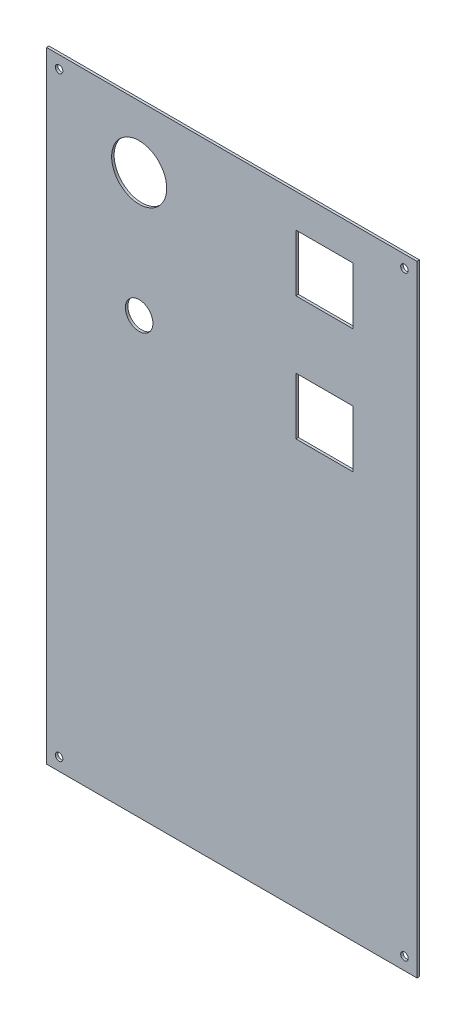
ISO-10303-21;
HEADER;
FILE_DESCRIPTION(('STEP AP214'),'2;1');
FILE_NAME('part.step','',(''),(''),'','','');
FILE_SCHEMA(('AUTOMOTIVE_DESIGN { 1 0 10303 214 1 1 1 1 }'));
ENDSEC;
DATA;
#1=APPLICATION_CONTEXT('core data for automotive mechanical design processes');
#2=APPLICATION_PROTOCOL_DEFINITION('international standard','automotive_design',2000,#1);
#3=PRODUCT_CONTEXT('',#1,'mechanical');
#4=PRODUCT('Part','Part','',(#3));
#5=PRODUCT_RELATED_PRODUCT_CATEGORY('part','',(#4));
#6=PRODUCT_DEFINITION_FORMATION('','',#4);
#7=PRODUCT_DEFINITION_CONTEXT('part definition',#1,'design');
#8=PRODUCT_DEFINITION('design','',#6,#7);
#9=PRODUCT_DEFINITION_SHAPE('','',#8);
#10=(LENGTH_UNIT() NAMED_UNIT(*) SI_UNIT(.MILLI.,.METRE.));
#11=(NAMED_UNIT(*) PLANE_ANGLE_UNIT() SI_UNIT($,.RADIAN.));
#12=(NAMED_UNIT(*) SI_UNIT($,.STERADIAN.) SOLID_ANGLE_UNIT());
#13=UNCERTAINTY_MEASURE_WITH_UNIT(LENGTH_MEASURE(1.E-05),#10,'distance_accuracy_value','');
#14=(GEOMETRIC_REPRESENTATION_CONTEXT(3) GLOBAL_UNCERTAINTY_ASSIGNED_CONTEXT((#13)) GLOBAL_UNIT_ASSIGNED_CONTEXT((#10,
#11,#12)) REPRESENTATION_CONTEXT('',''));
#15=CARTESIAN_POINT('',(0.,0.,0.));
#16=DIRECTION('',(0.,0.,1.));
#17=DIRECTION('',(1.,0.,0.));
#18=AXIS2_PLACEMENT_3D('',#15,#16,#17);
#19=CARTESIAN_POINT('',(0.,0.,2.));
#20=DIRECTION('',(0.,0.,-1.));
#21=DIRECTION('',(-1.00000000000001,0.,0.));
#22=AXIS2_PLACEMENT_3D('',#19,#20,#21);
#23=PLANE('',#22);
#24=DIRECTION('',(0.,1.,0.));
#25=VECTOR('',#24,1.);
#26=CARTESIAN_POINT('',(96.7500000000014,221.25,2.));
#27=LINE('',#26,#25);
#28=CARTESIAN_POINT('',(96.7500000000014,175.75,2.));
#29=VERTEX_POINT('',#28);
#30=CARTESIAN_POINT('',(96.7500000000014,221.25,2.));
#31=VERTEX_POINT('',#30);
#32=EDGE_CURVE('E162',#29,#31,#27,.T.);
#33=ORIENTED_EDGE('',*,*,#32,.F.);
#34=DIRECTION('',(1.00000000000001,0.,0.));
#35=VECTOR('',#34,1.);
#36=CARTESIAN_POINT('',(51.2500000000006,175.75,2.));
#37=LINE('',#36,#35);
#38=CARTESIAN_POINT('',(51.2500000000006,175.75,2.));
#39=VERTEX_POINT('',#38);
#40=EDGE_CURVE('E170',#39,#29,#37,.T.);
#41=ORIENTED_EDGE('',*,*,#40,.F.);
#42=DIRECTION('',(0.,-1.,0.));
#43=VECTOR('',#42,1.);
#44=CARTESIAN_POINT('',(51.2500000000006,221.25,2.));
#45=LINE('',#44,#43);
#46=CARTESIAN_POINT('',(51.2500000000006,221.25,2.));
#47=VERTEX_POINT('',#46);
#48=EDGE_CURVE('E167',#47,#39,#45,.T.);
#49=ORIENTED_EDGE('',*,*,#48,.F.);
#50=DIRECTION('',(-1.00000000000001,0.,0.));
#51=VECTOR('',#50,1.);
#52=CARTESIAN_POINT('',(51.2500000000006,221.25,2.));
#53=LINE('',#52,#51);
#54=EDGE_CURVE('E164',#31,#47,#53,.T.);
#55=ORIENTED_EDGE('',*,*,#54,.F.);
#56=EDGE_LOOP('',(#33,#41,#49,#55));
#57=FACE_BOUND('',#56,.T.);
#58=DIRECTION('',(0.,-1.,0.));
#59=VECTOR('',#58,1.);
#60=CARTESIAN_POINT('',(-148.000000000002,248.,2.));
#61=LINE('',#60,#59);
#62=CARTESIAN_POINT('',(-148.000000000002,248.,2.));
#63=VERTEX_POINT('',#62);
#64=CARTESIAN_POINT('',(-148.000000000002,-248.,2.));
#65=VERTEX_POINT('',#64);
#66=EDGE_CURVE('E193',#63,#65,#61,.T.);
#67=ORIENTED_EDGE('',*,*,#66,.T.);
#68=DIRECTION('',(1.00000000000001,0.,0.));
#69=VECTOR('',#68,1.);
#70=CARTESIAN_POINT('',(148.,-248.,2.));
#71=LINE('',#70,#69);
#72=CARTESIAN_POINT('',(148.,-248.,2.));
#73=VERTEX_POINT('',#72);
#74=EDGE_CURVE('E196',#65,#73,#71,.T.);
#75=ORIENTED_EDGE('',*,*,#74,.T.);
#76=DIRECTION('',(0.,1.,0.));
#77=VECTOR('',#76,1.);
#78=CARTESIAN_POINT('',(148.000000000002,248.,2.));
#79=LINE('',#78,#77);
#80=CARTESIAN_POINT('',(148.000000000002,248.,2.));
#81=VERTEX_POINT('',#80);
#82=EDGE_CURVE('E199',#73,#81,#79,.T.);
#83=ORIENTED_EDGE('',*,*,#82,.T.);
#84=DIRECTION('',(-1.00000000000001,0.,0.));
#85=VECTOR('',#84,1.);
#86=CARTESIAN_POINT('',(148.000000000002,248.,2.));
#87=LINE('',#86,#85);
#88=EDGE_CURVE('E201',#81,#63,#87,.T.);
#89=ORIENTED_EDGE('',*,*,#88,.T.);
#90=EDGE_LOOP('',(#67,#75,#83,#89));
#91=FACE_BOUND('',#90,.T.);
#92=DIRECTION('',(0.,1.,0.));
#93=VECTOR('',#92,1.);
#94=CARTESIAN_POINT('',(96.7500000000009,76.75,2.));
#95=LINE('',#94,#93);
#96=CARTESIAN_POINT('',(96.7500000000009,76.75,2.));
#97=VERTEX_POINT('',#96);
#98=CARTESIAN_POINT('',(96.7500000000013,122.25,2.));
#99=VERTEX_POINT('',#98);
#100=EDGE_CURVE('E123',#97,#99,#95,.T.);
#101=ORIENTED_EDGE('',*,*,#100,.F.);
#102=DIRECTION('',(1.00000000000001,0.,0.));
#103=VECTOR('',#102,1.);
#104=CARTESIAN_POINT('',(51.2500000000003,76.75,2.));
#105=LINE('',#104,#103);
#106=CARTESIAN_POINT('',(51.2500000000003,76.75,2.));
#107=VERTEX_POINT('',#106);
#108=EDGE_CURVE('E146',#107,#97,#105,.T.);
#109=ORIENTED_EDGE('',*,*,#108,.F.);
#110=DIRECTION('',(0.,-1.,0.));
#111=VECTOR('',#110,1.);
#112=CARTESIAN_POINT('',(51.2500000000003,76.75,2.));
#113=LINE('',#112,#111);
#114=CARTESIAN_POINT('',(51.2500000000006,122.25,2.));
#115=VERTEX_POINT('',#114);
#116=EDGE_CURVE('E144',#115,#107,#113,.T.);
#117=ORIENTED_EDGE('',*,*,#116,.F.);
#118=DIRECTION('',(-1.00000000000001,0.,0.));
#119=VECTOR('',#118,1.);
#120=CARTESIAN_POINT('',(51.2500000000006,122.25,2.));
#121=LINE('',#120,#119);
#122=EDGE_CURVE('E131',#99,#115,#121,.T.);
#123=ORIENTED_EDGE('',*,*,#122,.F.);
#124=EDGE_LOOP('',(#101,#109,#117,#123));
#125=FACE_BOUND('',#124,.T.);
#126=CARTESIAN_POINT('',(-74.,99.4999999999999,2.));
#127=DIRECTION('',(0.,0.,1.));
#128=DIRECTION('',(1.00000000000001,0.,0.));
#129=AXIS2_PLACEMENT_3D('',#126,#127,#128);
#130=CIRCLE('',#129,11.);
#131=CARTESIAN_POINT('',(-62.9999999999999,99.5,2.));
#132=VERTEX_POINT('',#131);
#133=EDGE_CURVE('E152',#132,#132,#130,.T.);
#134=ORIENTED_EDGE('',*,*,#133,.F.);
#135=EDGE_LOOP('',(#134));
#136=FACE_BOUND('',#135,.T.);
#137=CARTESIAN_POINT('',(-74.,198.5,2.));
#138=DIRECTION('',(0.,0.,1.));
#139=DIRECTION('',(1.00000000000001,0.,0.));
#140=AXIS2_PLACEMENT_3D('',#137,#138,#139);
#141=CIRCLE('',#140,22.);
#142=CARTESIAN_POINT('',(-51.9999999999997,198.5,2.));
#143=VERTEX_POINT('',#142);
#144=EDGE_CURVE('E352',#143,#143,#141,.T.);
#145=ORIENTED_EDGE('',*,*,#144,.F.);
#146=EDGE_LOOP('',(#145));
#147=FACE_BOUND('',#146,.T.);
#148=CARTESIAN_POINT('',(-138.000000000002,238.,2.));
#149=DIRECTION('',(0.,0.,1.));
#150=DIRECTION('',(1.00000000000001,0.,0.));
#151=AXIS2_PLACEMENT_3D('',#148,#149,#150);
#152=CIRCLE('',#151,2.99999999999999);
#153=CARTESIAN_POINT('',(-135.000000000002,238.,2.));
#154=VERTEX_POINT('',#153);
#155=EDGE_CURVE('E346',#154,#154,#152,.T.);
#156=ORIENTED_EDGE('',*,*,#155,.F.);
#157=EDGE_LOOP('',(#156));
#158=FACE_BOUND('',#157,.T.);
#159=CARTESIAN_POINT('',(138.000000000001,238.,2.));
#160=DIRECTION('',(0.,0.,1.));
#161=DIRECTION('',(1.00000000000001,0.,0.));
#162=AXIS2_PLACEMENT_3D('',#159,#160,#161);
#163=CIRCLE('',#162,2.99999999999999);
#164=CARTESIAN_POINT('',(141.000000000001,238.,2.));
#165=VERTEX_POINT('',#164);
#166=EDGE_CURVE('E340',#165,#165,#163,.T.);
#167=ORIENTED_EDGE('',*,*,#166,.F.);
#168=EDGE_LOOP('',(#167));
#169=FACE_BOUND('',#168,.T.);
#170=CARTESIAN_POINT('',(-138.000000000003,-238.,2.));
#171=DIRECTION('',(0.,0.,1.));
#172=DIRECTION('',(1.00000000000001,0.,0.));
#173=AXIS2_PLACEMENT_3D('',#170,#171,#172);
#174=CIRCLE('',#173,2.99999999999999);
#175=CARTESIAN_POINT('',(-135.000000000002,-238.,2.));
#176=VERTEX_POINT('',#175);
#177=EDGE_CURVE('E334',#176,#176,#174,.T.);
#178=ORIENTED_EDGE('',*,*,#177,.F.);
#179=EDGE_LOOP('',(#178));
#180=FACE_BOUND('',#179,.T.);
#181=CARTESIAN_POINT('',(138.,-238.,2.));
#182=DIRECTION('',(0.,0.,1.));
#183=DIRECTION('',(1.00000000000001,0.,0.));
#184=AXIS2_PLACEMENT_3D('',#181,#182,#183);
#185=CIRCLE('',#184,2.99999999999999);
#186=CARTESIAN_POINT('',(141.,-238.,2.));
#187=VERTEX_POINT('',#186);
#188=EDGE_CURVE('E325',#187,#187,#185,.T.);
#189=ORIENTED_EDGE('',*,*,#188,.F.);
#190=EDGE_LOOP('',(#189));
#191=FACE_BOUND('',#190,.T.);
#192=ADVANCED_FACE('F34',(#57,#91,#125,#136,#147,#158,#169,#180,#191),#23,.F.);
#193=CARTESIAN_POINT('',(0.,0.,0.));
#194=DIRECTION('',(0.,0.,-1.));
#195=DIRECTION('',(-1.00000000000001,0.,0.));
#196=AXIS2_PLACEMENT_3D('',#193,#194,#195);
#197=PLANE('',#196);
#198=CARTESIAN_POINT('',(-138.000000000003,-238.,0.));
#199=DIRECTION('',(0.,0.,1.));
#200=DIRECTION('',(1.00000000000001,0.,0.));
#201=AXIS2_PLACEMENT_3D('',#198,#199,#200);
#202=CIRCLE('',#201,2.99999999999999);
#203=CARTESIAN_POINT('',(-135.000000000002,-238.,0.));
#204=VERTEX_POINT('',#203);
#205=EDGE_CURVE('E331',#204,#204,#202,.T.);
#206=ORIENTED_EDGE('',*,*,#205,.T.);
#207=EDGE_LOOP('',(#206));
#208=FACE_BOUND('',#207,.T.);
#209=CARTESIAN_POINT('',(-138.000000000002,238.,0.));
#210=DIRECTION('',(0.,0.,1.));
#211=DIRECTION('',(1.00000000000001,0.,0.));
#212=AXIS2_PLACEMENT_3D('',#209,#210,#211);
#213=CIRCLE('',#212,2.99999999999999);
#214=CARTESIAN_POINT('',(-135.000000000002,238.,0.));
#215=VERTEX_POINT('',#214);
#216=EDGE_CURVE('E343',#215,#215,#213,.T.);
#217=ORIENTED_EDGE('',*,*,#216,.T.);
#218=EDGE_LOOP('',(#217));
#219=FACE_BOUND('',#218,.T.);
#220=CARTESIAN_POINT('',(-74.,99.4999999999999,0.));
#221=DIRECTION('',(0.,0.,1.));
#222=DIRECTION('',(1.00000000000001,0.,0.));
#223=AXIS2_PLACEMENT_3D('',#220,#221,#222);
#224=CIRCLE('',#223,11.);
#225=CARTESIAN_POINT('',(-62.9999999999999,99.5,0.));
#226=VERTEX_POINT('',#225);
#227=EDGE_CURVE('E355',#226,#226,#224,.T.);
#228=ORIENTED_EDGE('',*,*,#227,.T.);
#229=EDGE_LOOP('',(#228));
#230=FACE_BOUND('',#229,.T.);
#231=DIRECTION('',(0.,-1.,0.));
#232=VECTOR('',#231,1.);
#233=CARTESIAN_POINT('',(-148.000000000002,248.,0.));
#234=LINE('',#233,#232);
#235=CARTESIAN_POINT('',(-148.000000000002,248.,0.));
#236=VERTEX_POINT('',#235);
#237=CARTESIAN_POINT('',(-148.000000000002,-248.,0.));
#238=VERTEX_POINT('',#237);
#239=EDGE_CURVE('E192',#236,#238,#234,.T.);
#240=ORIENTED_EDGE('',*,*,#239,.F.);
#241=DIRECTION('',(-1.00000000000001,0.,0.));
#242=VECTOR('',#241,1.);
#243=CARTESIAN_POINT('',(148.000000000002,248.,0.));
#244=LINE('',#243,#242);
#245=CARTESIAN_POINT('',(148.000000000002,248.,0.));
#246=VERTEX_POINT('',#245);
#247=EDGE_CURVE('E197',#246,#236,#244,.T.);
#248=ORIENTED_EDGE('',*,*,#247,.F.);
#249=DIRECTION('',(0.,1.,0.));
#250=VECTOR('',#249,1.);
#251=CARTESIAN_POINT('',(148.000000000002,248.,0.));
#252=LINE('',#251,#250);
#253=CARTESIAN_POINT('',(148.,-248.,0.));
#254=VERTEX_POINT('',#253);
#255=EDGE_CURVE('E208',#254,#246,#252,.T.);
#256=ORIENTED_EDGE('',*,*,#255,.F.);
#257=DIRECTION('',(1.00000000000001,0.,0.));
#258=VECTOR('',#257,1.);
#259=CARTESIAN_POINT('',(148.,-248.,0.));
#260=LINE('',#259,#258);
#261=EDGE_CURVE('E206',#238,#254,#260,.T.);
#262=ORIENTED_EDGE('',*,*,#261,.F.);
#263=EDGE_LOOP('',(#240,#248,#256,#262));
#264=FACE_BOUND('',#263,.T.);
#265=DIRECTION('',(1.00000000000001,0.,0.));
#266=VECTOR('',#265,1.);
#267=CARTESIAN_POINT('',(51.2500000000006,175.75,0.));
#268=LINE('',#267,#266);
#269=CARTESIAN_POINT('',(51.2500000000006,175.75,0.));
#270=VERTEX_POINT('',#269);
#271=CARTESIAN_POINT('',(96.7500000000014,175.75,0.));
#272=VERTEX_POINT('',#271);
#273=EDGE_CURVE('E165',#270,#272,#268,.T.);
#274=ORIENTED_EDGE('',*,*,#273,.T.);
#275=DIRECTION('',(0.,1.,0.));
#276=VECTOR('',#275,1.);
#277=CARTESIAN_POINT('',(96.7500000000014,221.25,0.));
#278=LINE('',#277,#276);
#279=CARTESIAN_POINT('',(96.7500000000014,221.25,0.));
#280=VERTEX_POINT('',#279);
#281=EDGE_CURVE('E139',#272,#280,#278,.T.);
#282=ORIENTED_EDGE('',*,*,#281,.T.);
#283=DIRECTION('',(-1.00000000000001,0.,0.));
#284=VECTOR('',#283,1.);
#285=CARTESIAN_POINT('',(51.2500000000006,221.25,0.));
#286=LINE('',#285,#284);
#287=CARTESIAN_POINT('',(51.2500000000006,221.25,0.));
#288=VERTEX_POINT('',#287);
#289=EDGE_CURVE('E175',#280,#288,#286,.T.);
#290=ORIENTED_EDGE('',*,*,#289,.T.);
#291=DIRECTION('',(0.,-1.,0.));
#292=VECTOR('',#291,1.);
#293=CARTESIAN_POINT('',(51.2500000000006,221.25,0.));
#294=LINE('',#293,#292);
#295=EDGE_CURVE('E178',#288,#270,#294,.T.);
#296=ORIENTED_EDGE('',*,*,#295,.T.);
#297=EDGE_LOOP('',(#274,#282,#290,#296));
#298=FACE_BOUND('',#297,.T.);
#299=DIRECTION('',(1.00000000000001,0.,0.));
#300=VECTOR('',#299,1.);
#301=CARTESIAN_POINT('',(51.2500000000003,76.75,0.));
#302=LINE('',#301,#300);
#303=CARTESIAN_POINT('',(51.2500000000003,76.75,0.));
#304=VERTEX_POINT('',#303);
#305=CARTESIAN_POINT('',(96.7500000000009,76.75,0.));
#306=VERTEX_POINT('',#305);
#307=EDGE_CURVE('E132',#304,#306,#302,.T.);
#308=ORIENTED_EDGE('',*,*,#307,.T.);
#309=DIRECTION('',(0.,1.,0.));
#310=VECTOR('',#309,1.);
#311=CARTESIAN_POINT('',(96.7500000000009,76.75,0.));
#312=LINE('',#311,#310);
#313=CARTESIAN_POINT('',(96.7500000000011,122.25,0.));
#314=VERTEX_POINT('',#313);
#315=EDGE_CURVE('E57',#306,#314,#312,.T.);
#316=ORIENTED_EDGE('',*,*,#315,.T.);
#317=DIRECTION('',(-1.00000000000001,0.,0.));
#318=VECTOR('',#317,1.);
#319=CARTESIAN_POINT('',(51.2500000000005,122.25,0.));
#320=LINE('',#319,#318);
#321=CARTESIAN_POINT('',(51.2500000000005,122.25,0.));
#322=VERTEX_POINT('',#321);
#323=EDGE_CURVE('E138',#314,#322,#320,.T.);
#324=ORIENTED_EDGE('',*,*,#323,.T.);
#325=DIRECTION('',(0.,-1.,0.));
#326=VECTOR('',#325,1.);
#327=CARTESIAN_POINT('',(51.2500000000003,76.75,0.));
#328=LINE('',#327,#326);
#329=EDGE_CURVE('E154',#322,#304,#328,.T.);
#330=ORIENTED_EDGE('',*,*,#329,.T.);
#331=EDGE_LOOP('',(#308,#316,#324,#330));
#332=FACE_BOUND('',#331,.T.);
#333=CARTESIAN_POINT('',(-74.,198.5,0.));
#334=DIRECTION('',(0.,0.,1.));
#335=DIRECTION('',(1.00000000000001,0.,0.));
#336=AXIS2_PLACEMENT_3D('',#333,#334,#335);
#337=CIRCLE('',#336,22.);
#338=CARTESIAN_POINT('',(-51.9999999999997,198.5,0.));
#339=VERTEX_POINT('',#338);
#340=EDGE_CURVE('E349',#339,#339,#337,.T.);
#341=ORIENTED_EDGE('',*,*,#340,.T.);
#342=EDGE_LOOP('',(#341));
#343=FACE_BOUND('',#342,.T.);
#344=CARTESIAN_POINT('',(138.000000000001,238.,0.));
#345=DIRECTION('',(0.,0.,1.));
#346=DIRECTION('',(1.00000000000001,0.,0.));
#347=AXIS2_PLACEMENT_3D('',#344,#345,#346);
#348=CIRCLE('',#347,2.99999999999999);
#349=CARTESIAN_POINT('',(141.000000000001,238.,0.));
#350=VERTEX_POINT('',#349);
#351=EDGE_CURVE('E337',#350,#350,#348,.T.);
#352=ORIENTED_EDGE('',*,*,#351,.T.);
#353=EDGE_LOOP('',(#352));
#354=FACE_BOUND('',#353,.T.);
#355=CARTESIAN_POINT('',(138.,-238.,0.));
#356=DIRECTION('',(0.,0.,1.));
#357=DIRECTION('',(1.00000000000001,0.,0.));
#358=AXIS2_PLACEMENT_3D('',#355,#356,#357);
#359=CIRCLE('',#358,2.99999999999999);
#360=CARTESIAN_POINT('',(141.,-238.,0.));
#361=VERTEX_POINT('',#360);
#362=EDGE_CURVE('E328',#361,#361,#359,.T.);
#363=ORIENTED_EDGE('',*,*,#362,.T.);
#364=EDGE_LOOP('',(#363));
#365=FACE_BOUND('',#364,.T.);
#366=ADVANCED_FACE('F226',(#208,#219,#230,#264,#298,#332,#343,#354,#365),#197,.T.);
#367=CARTESIAN_POINT('',(-148.000000000002,248.,2.));
#368=DIRECTION('',(1.00000000000001,0.,0.));
#369=DIRECTION('',(0.,1.,0.));
#370=AXIS2_PLACEMENT_3D('',#367,#368,#369);
#371=PLANE('',#370);
#372=ORIENTED_EDGE('',*,*,#239,.T.);
#373=DIRECTION('',(0.,0.,-1.));
#374=VECTOR('',#373,1.);
#375=CARTESIAN_POINT('',(-148.000000000002,-248.,2.));
#376=LINE('',#375,#374);
#377=EDGE_CURVE('E11',#65,#238,#376,.T.);
#378=ORIENTED_EDGE('',*,*,#377,.F.);
#379=ORIENTED_EDGE('',*,*,#66,.F.);
#380=DIRECTION('',(0.,0.,-1.));
#381=VECTOR('',#380,1.);
#382=CARTESIAN_POINT('',(-148.000000000002,248.,2.));
#383=LINE('',#382,#381);
#384=EDGE_CURVE('E203',#63,#236,#383,.T.);
#385=ORIENTED_EDGE('',*,*,#384,.T.);
#386=EDGE_LOOP('',(#372,#378,#379,#385));
#387=FACE_BOUND('',#386,.T.);
#388=ADVANCED_FACE('F36',(#387),#371,.F.);
#389=CARTESIAN_POINT('',(148.,-248.,2.));
#390=DIRECTION('',(0.,1.,0.));
#391=DIRECTION('',(-1.00000000000001,0.,0.));
#392=AXIS2_PLACEMENT_3D('',#389,#390,#391);
#393=PLANE('',#392);
#394=ORIENTED_EDGE('',*,*,#261,.T.);
#395=DIRECTION('',(0.,0.,-1.));
#396=VECTOR('',#395,1.);
#397=CARTESIAN_POINT('',(148.,-248.,2.));
#398=LINE('',#397,#396);
#399=EDGE_CURVE('E42',#73,#254,#398,.T.);
#400=ORIENTED_EDGE('',*,*,#399,.F.);
#401=ORIENTED_EDGE('',*,*,#74,.F.);
#402=ORIENTED_EDGE('',*,*,#377,.T.);
#403=EDGE_LOOP('',(#394,#400,#401,#402));
#404=FACE_BOUND('',#403,.T.);
#405=ADVANCED_FACE('F236',(#404),#393,.F.);
#406=CARTESIAN_POINT('',(148.000000000002,248.,2.));
#407=DIRECTION('',(-1.00000000000001,0.,0.));
#408=DIRECTION('',(0.,-1.,0.));
#409=AXIS2_PLACEMENT_3D('',#406,#407,#408);
#410=PLANE('',#409);
#411=ORIENTED_EDGE('',*,*,#255,.T.);
#412=DIRECTION('',(0.,0.,-1.));
#413=VECTOR('',#412,1.);
#414=CARTESIAN_POINT('',(148.000000000002,248.,2.));
#415=LINE('',#414,#413);
#416=EDGE_CURVE('E213',#81,#246,#415,.T.);
#417=ORIENTED_EDGE('',*,*,#416,.F.);
#418=ORIENTED_EDGE('',*,*,#82,.F.);
#419=ORIENTED_EDGE('',*,*,#399,.T.);
#420=EDGE_LOOP('',(#411,#417,#418,#419));
#421=FACE_BOUND('',#420,.T.);
#422=ADVANCED_FACE('F220',(#421),#410,.F.);
#423=CARTESIAN_POINT('',(148.000000000002,248.,2.));
#424=DIRECTION('',(0.,-1.,0.));
#425=DIRECTION('',(1.00000000000001,0.,0.));
#426=AXIS2_PLACEMENT_3D('',#423,#424,#425);
#427=PLANE('',#426);
#428=ORIENTED_EDGE('',*,*,#247,.T.);
#429=ORIENTED_EDGE('',*,*,#384,.F.);
#430=ORIENTED_EDGE('',*,*,#88,.F.);
#431=ORIENTED_EDGE('',*,*,#416,.T.);
#432=EDGE_LOOP('',(#428,#429,#430,#431));
#433=FACE_BOUND('',#432,.T.);
#434=ADVANCED_FACE('F230',(#433),#427,.F.);
#435=CARTESIAN_POINT('',(96.7500000000014,221.25,2.));
#436=DIRECTION('',(-1.00000000000001,0.,0.));
#437=DIRECTION('',(0.,0.,1.));
#438=AXIS2_PLACEMENT_3D('',#435,#436,#437);
#439=PLANE('',#438);
#440=ORIENTED_EDGE('',*,*,#281,.F.);
#441=DIRECTION('',(0.,0.,-1.));
#442=VECTOR('',#441,1.);
#443=CARTESIAN_POINT('',(96.7500000000014,175.75,2.));
#444=LINE('',#443,#442);
#445=EDGE_CURVE('E172',#29,#272,#444,.T.);
#446=ORIENTED_EDGE('',*,*,#445,.F.);
#447=ORIENTED_EDGE('',*,*,#32,.T.);
#448=DIRECTION('',(0.,0.,-1.));
#449=VECTOR('',#448,1.);
#450=CARTESIAN_POINT('',(96.7500000000014,221.25,2.));
#451=LINE('',#450,#449);
#452=EDGE_CURVE('E189',#31,#280,#451,.T.);
#453=ORIENTED_EDGE('',*,*,#452,.T.);
#454=EDGE_LOOP('',(#440,#446,#447,#453));
#455=FACE_BOUND('',#454,.T.);
#456=ADVANCED_FACE('F253',(#455),#439,.T.);
#457=CARTESIAN_POINT('',(51.2500000000006,221.25,2.));
#458=DIRECTION('',(0.,-1.,0.));
#459=DIRECTION('',(0.,0.,-1.));
#460=AXIS2_PLACEMENT_3D('',#457,#458,#459);
#461=PLANE('',#460);
#462=ORIENTED_EDGE('',*,*,#289,.F.);
#463=ORIENTED_EDGE('',*,*,#452,.F.);
#464=ORIENTED_EDGE('',*,*,#54,.T.);
#465=DIRECTION('',(0.,0.,-1.));
#466=VECTOR('',#465,1.);
#467=CARTESIAN_POINT('',(51.2500000000006,221.25,2.));
#468=LINE('',#467,#466);
#469=EDGE_CURVE('E187',#47,#288,#468,.T.);
#470=ORIENTED_EDGE('',*,*,#469,.T.);
#471=EDGE_LOOP('',(#462,#463,#464,#470));
#472=FACE_BOUND('',#471,.T.);
#473=ADVANCED_FACE('F260',(#472),#461,.T.);
#474=CARTESIAN_POINT('',(51.2500000000006,221.25,2.));
#475=DIRECTION('',(1.00000000000001,0.,0.));
#476=DIRECTION('',(0.,0.,-1.));
#477=AXIS2_PLACEMENT_3D('',#474,#475,#476);
#478=PLANE('',#477);
#479=ORIENTED_EDGE('',*,*,#295,.F.);
#480=ORIENTED_EDGE('',*,*,#469,.F.);
#481=ORIENTED_EDGE('',*,*,#48,.T.);
#482=DIRECTION('',(0.,0.,-1.));
#483=VECTOR('',#482,1.);
#484=CARTESIAN_POINT('',(51.2500000000006,175.75,2.));
#485=LINE('',#484,#483);
#486=EDGE_CURVE('E185',#39,#270,#485,.T.);
#487=ORIENTED_EDGE('',*,*,#486,.T.);
#488=EDGE_LOOP('',(#479,#480,#481,#487));
#489=FACE_BOUND('',#488,.T.);
#490=ADVANCED_FACE('F265',(#489),#478,.T.);
#491=CARTESIAN_POINT('',(51.2500000000006,175.75,2.));
#492=DIRECTION('',(0.,1.,0.));
#493=DIRECTION('',(0.,0.,1.));
#494=AXIS2_PLACEMENT_3D('',#491,#492,#493);
#495=PLANE('',#494);
#496=ORIENTED_EDGE('',*,*,#273,.F.);
#497=ORIENTED_EDGE('',*,*,#486,.F.);
#498=ORIENTED_EDGE('',*,*,#40,.T.);
#499=ORIENTED_EDGE('',*,*,#445,.T.);
#500=EDGE_LOOP('',(#496,#497,#498,#499));
#501=FACE_BOUND('',#500,.T.);
#502=ADVANCED_FACE('F271',(#501),#495,.T.);
#503=CARTESIAN_POINT('',(96.7500000000009,76.75,2.));
#504=DIRECTION('',(-1.00000000000001,0.,0.));
#505=DIRECTION('',(0.,0.,1.));
#506=AXIS2_PLACEMENT_3D('',#503,#504,#505);
#507=PLANE('',#506);
#508=ORIENTED_EDGE('',*,*,#315,.F.);
#509=DIRECTION('',(0.,0.,-1.));
#510=VECTOR('',#509,1.);
#511=CARTESIAN_POINT('',(96.7500000000009,76.75,2.));
#512=LINE('',#511,#510);
#513=EDGE_CURVE('E127',#97,#306,#512,.T.);
#514=ORIENTED_EDGE('',*,*,#513,.F.);
#515=ORIENTED_EDGE('',*,*,#100,.T.);
#516=DIRECTION('',(0.,0.,-1.));
#517=VECTOR('',#516,1.);
#518=CARTESIAN_POINT('',(96.7500000000013,122.25,2.));
#519=LINE('',#518,#517);
#520=EDGE_CURVE('E126',#99,#314,#519,.T.);
#521=ORIENTED_EDGE('',*,*,#520,.T.);
#522=EDGE_LOOP('',(#508,#514,#515,#521));
#523=FACE_BOUND('',#522,.T.);
#524=ADVANCED_FACE('F125',(#523),#507,.T.);
#525=CARTESIAN_POINT('',(51.2500000000006,122.25,2.));
#526=DIRECTION('',(0.,-1.,0.));
#527=DIRECTION('',(0.,0.,-1.));
#528=AXIS2_PLACEMENT_3D('',#525,#526,#527);
#529=PLANE('',#528);
#530=ORIENTED_EDGE('',*,*,#323,.F.);
#531=ORIENTED_EDGE('',*,*,#520,.F.);
#532=ORIENTED_EDGE('',*,*,#122,.T.);
#533=DIRECTION('',(0.,0.,-1.));
#534=VECTOR('',#533,1.);
#535=CARTESIAN_POINT('',(51.2500000000006,122.25,2.));
#536=LINE('',#535,#534);
#537=EDGE_CURVE('E140',#115,#322,#536,.T.);
#538=ORIENTED_EDGE('',*,*,#537,.T.);
#539=EDGE_LOOP('',(#530,#531,#532,#538));
#540=FACE_BOUND('',#539,.T.);
#541=ADVANCED_FACE('F135',(#540),#529,.T.);
#542=CARTESIAN_POINT('',(51.2500000000003,76.75,2.));
#543=DIRECTION('',(1.00000000000001,0.,0.));
#544=DIRECTION('',(0.,0.,-1.));
#545=AXIS2_PLACEMENT_3D('',#542,#543,#544);
#546=PLANE('',#545);
#547=ORIENTED_EDGE('',*,*,#329,.F.);
#548=ORIENTED_EDGE('',*,*,#537,.F.);
#549=ORIENTED_EDGE('',*,*,#116,.T.);
#550=DIRECTION('',(0.,0.,-1.));
#551=VECTOR('',#550,1.);
#552=CARTESIAN_POINT('',(51.2500000000003,76.75,2.));
#553=LINE('',#552,#551);
#554=EDGE_CURVE('E49',#107,#304,#553,.T.);
#555=ORIENTED_EDGE('',*,*,#554,.T.);
#556=EDGE_LOOP('',(#547,#548,#549,#555));
#557=FACE_BOUND('',#556,.T.);
#558=ADVANCED_FACE('F290',(#557),#546,.T.);
#559=CARTESIAN_POINT('',(51.2500000000003,76.75,2.));
#560=DIRECTION('',(0.,1.,0.));
#561=DIRECTION('',(0.,0.,1.));
#562=AXIS2_PLACEMENT_3D('',#559,#560,#561);
#563=PLANE('',#562);
#564=ORIENTED_EDGE('',*,*,#307,.F.);
#565=ORIENTED_EDGE('',*,*,#554,.F.);
#566=ORIENTED_EDGE('',*,*,#108,.T.);
#567=ORIENTED_EDGE('',*,*,#513,.T.);
#568=EDGE_LOOP('',(#564,#565,#566,#567));
#569=FACE_BOUND('',#568,.T.);
#570=ADVANCED_FACE('F293',(#569),#563,.T.);
#571=CARTESIAN_POINT('',(-74.,99.4999999999999,2.));
#572=DIRECTION('',(0.,0.,-1.));
#573=DIRECTION('',(-1.00000000000001,0.,0.));
#574=AXIS2_PLACEMENT_3D('',#571,#572,#573);
#575=CYLINDRICAL_SURFACE('',#574,11.);
#576=ORIENTED_EDGE('',*,*,#133,.T.);
#577=EDGE_LOOP('',(#576));
#578=FACE_BOUND('',#577,.T.);
#579=ORIENTED_EDGE('',*,*,#227,.F.);
#580=EDGE_LOOP('',(#579));
#581=FACE_BOUND('',#580,.T.);
#582=ADVANCED_FACE('F297',(#578,#581),#575,.F.);
#583=CARTESIAN_POINT('',(-74.,198.5,2.));
#584=DIRECTION('',(0.,0.,-1.));
#585=DIRECTION('',(-1.00000000000001,0.,0.));
#586=AXIS2_PLACEMENT_3D('',#583,#584,#585);
#587=CYLINDRICAL_SURFACE('',#586,22.);
#588=ORIENTED_EDGE('',*,*,#144,.T.);
#589=EDGE_LOOP('',(#588));
#590=FACE_BOUND('',#589,.T.);
#591=ORIENTED_EDGE('',*,*,#340,.F.);
#592=EDGE_LOOP('',(#591));
#593=FACE_BOUND('',#592,.T.);
#594=ADVANCED_FACE('F300',(#590,#593),#587,.F.);
#595=CARTESIAN_POINT('',(-138.000000000002,238.,2.));
#596=DIRECTION('',(0.,0.,-1.));
#597=DIRECTION('',(-1.00000000000001,0.,0.));
#598=AXIS2_PLACEMENT_3D('',#595,#596,#597);
#599=CYLINDRICAL_SURFACE('',#598,2.99999999999999);
#600=ORIENTED_EDGE('',*,*,#155,.T.);
#601=EDGE_LOOP('',(#600));
#602=FACE_BOUND('',#601,.T.);
#603=ORIENTED_EDGE('',*,*,#216,.F.);
#604=EDGE_LOOP('',(#603));
#605=FACE_BOUND('',#604,.T.);
#606=ADVANCED_FACE('F304',(#602,#605),#599,.F.);
#607=CARTESIAN_POINT('',(138.000000000001,238.,2.));
#608=DIRECTION('',(0.,0.,-1.));
#609=DIRECTION('',(-1.00000000000001,0.,0.));
#610=AXIS2_PLACEMENT_3D('',#607,#608,#609);
#611=CYLINDRICAL_SURFACE('',#610,2.99999999999999);
#612=ORIENTED_EDGE('',*,*,#166,.T.);
#613=EDGE_LOOP('',(#612));
#614=FACE_BOUND('',#613,.T.);
#615=ORIENTED_EDGE('',*,*,#351,.F.);
#616=EDGE_LOOP('',(#615));
#617=FACE_BOUND('',#616,.T.);
#618=ADVANCED_FACE('F308',(#614,#617),#611,.F.);
#619=CARTESIAN_POINT('',(-138.000000000003,-238.,2.));
#620=DIRECTION('',(0.,0.,-1.));
#621=DIRECTION('',(-1.00000000000001,0.,0.));
#622=AXIS2_PLACEMENT_3D('',#619,#620,#621);
#623=CYLINDRICAL_SURFACE('',#622,2.99999999999999);
#624=ORIENTED_EDGE('',*,*,#177,.T.);
#625=EDGE_LOOP('',(#624));
#626=FACE_BOUND('',#625,.T.);
#627=ORIENTED_EDGE('',*,*,#205,.F.);
#628=EDGE_LOOP('',(#627));
#629=FACE_BOUND('',#628,.T.);
#630=ADVANCED_FACE('F312',(#626,#629),#623,.F.);
#631=CARTESIAN_POINT('',(138.,-238.,2.));
#632=DIRECTION('',(0.,0.,-1.));
#633=DIRECTION('',(-1.00000000000001,0.,0.));
#634=AXIS2_PLACEMENT_3D('',#631,#632,#633);
#635=CYLINDRICAL_SURFACE('',#634,2.99999999999999);
#636=ORIENTED_EDGE('',*,*,#188,.T.);
#637=EDGE_LOOP('',(#636));
#638=FACE_BOUND('',#637,.T.);
#639=ORIENTED_EDGE('',*,*,#362,.F.);
#640=EDGE_LOOP('',(#639));
#641=FACE_BOUND('',#640,.T.);
#642=ADVANCED_FACE('F316',(#638,#641),#635,.F.);
#643=CLOSED_SHELL('',(#192,#366,#388,#405,#422,#434,#456,#473,#490,#502,#524,#541,#558,#570,
#582,#594,#606,#618,#630,#642));
#644=MANIFOLD_SOLID_BREP('B2',#643);
#645=ADVANCED_BREP_SHAPE_REPRESENTATION('',(#18,#644),#14);
#646=SHAPE_DEFINITION_REPRESENTATION(#9,#645);
ENDSEC;
END-ISO-10303-21;
